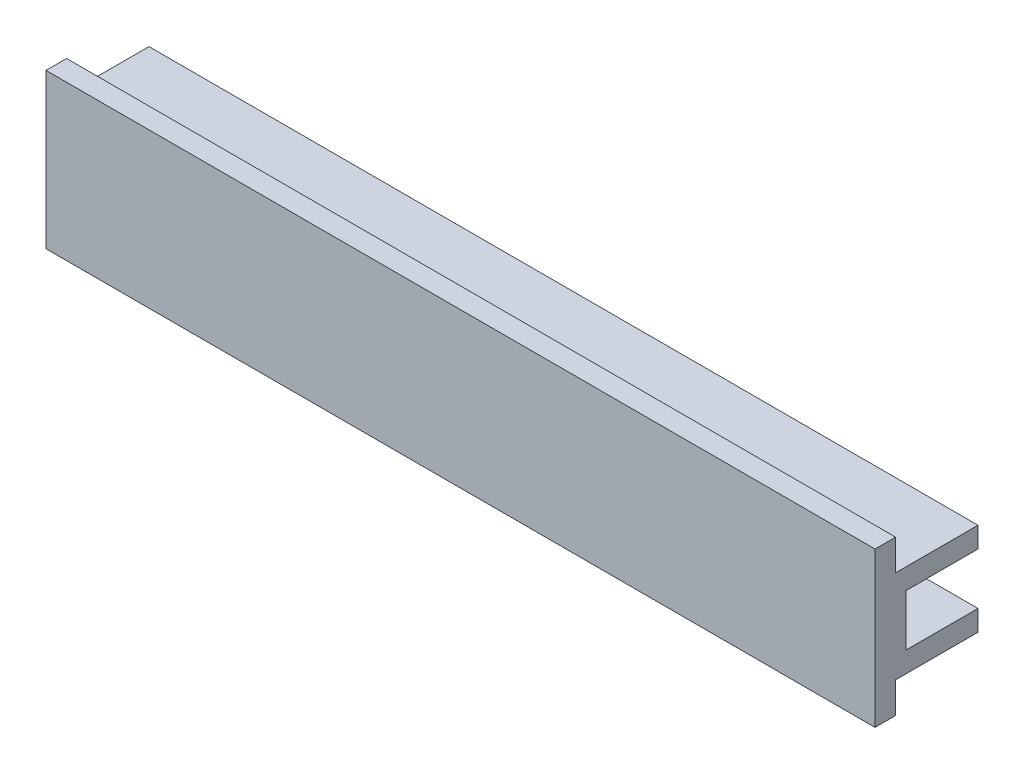
ISO-10303-21;
HEADER;
FILE_DESCRIPTION(('STEP AP214'),'2;1');
FILE_NAME('part.step','',(''),(''),'','','');
FILE_SCHEMA(('AUTOMOTIVE_DESIGN { 1 0 10303 214 1 1 1 1 }'));
ENDSEC;
DATA;
#1=APPLICATION_CONTEXT('core data for automotive mechanical design processes');
#2=APPLICATION_PROTOCOL_DEFINITION('international standard','automotive_design',2000,#1);
#3=PRODUCT_CONTEXT('',#1,'mechanical');
#4=PRODUCT('Part','Part','',(#3));
#5=PRODUCT_RELATED_PRODUCT_CATEGORY('part','',(#4));
#6=PRODUCT_DEFINITION_FORMATION('','',#4);
#7=PRODUCT_DEFINITION_CONTEXT('part definition',#1,'design');
#8=PRODUCT_DEFINITION('design','',#6,#7);
#9=PRODUCT_DEFINITION_SHAPE('','',#8);
#10=(LENGTH_UNIT() NAMED_UNIT(*) SI_UNIT(.MILLI.,.METRE.));
#11=(NAMED_UNIT(*) PLANE_ANGLE_UNIT() SI_UNIT($,.RADIAN.));
#12=(NAMED_UNIT(*) SI_UNIT($,.STERADIAN.) SOLID_ANGLE_UNIT());
#13=UNCERTAINTY_MEASURE_WITH_UNIT(LENGTH_MEASURE(1.E-05),#10,'distance_accuracy_value','');
#14=(GEOMETRIC_REPRESENTATION_CONTEXT(3) GLOBAL_UNCERTAINTY_ASSIGNED_CONTEXT((#13)) GLOBAL_UNIT_ASSIGNED_CONTEXT((#10,
#11,#12)) REPRESENTATION_CONTEXT('',''));
#15=CARTESIAN_POINT('',(0.,0.,0.));
#16=DIRECTION('',(0.,0.,1.));
#17=DIRECTION('',(1.,0.,0.));
#18=AXIS2_PLACEMENT_3D('',#15,#16,#17);
#19=CARTESIAN_POINT('',(40.25,7.5,5.));
#20=DIRECTION('',(0.,0.,-1.));
#21=DIRECTION('',(0.,1.,0.));
#22=AXIS2_PLACEMENT_3D('',#19,#20,#21);
#23=PLANE('',#22);
#24=DIRECTION('',(0.,-1.,0.));
#25=VECTOR('',#24,1.);
#26=CARTESIAN_POINT('',(-40.25,7.5,5.));
#27=LINE('',#26,#25);
#28=CARTESIAN_POINT('',(-40.25,7.5,5.));
#29=VERTEX_POINT('',#28);
#30=CARTESIAN_POINT('',(-40.25,-7.5,5.));
#31=VERTEX_POINT('',#30);
#32=EDGE_CURVE('E149',#29,#31,#27,.T.);
#33=ORIENTED_EDGE('',*,*,#32,.T.);
#34=DIRECTION('',(-1.,0.,0.));
#35=VECTOR('',#34,1.);
#36=CARTESIAN_POINT('',(40.25,-7.5,5.));
#37=LINE('',#36,#35);
#38=CARTESIAN_POINT('',(40.25,-7.5,5.));
#39=VERTEX_POINT('',#38);
#40=EDGE_CURVE('E11',#39,#31,#37,.T.);
#41=ORIENTED_EDGE('',*,*,#40,.F.);
#42=DIRECTION('',(0.,-1.,0.));
#43=VECTOR('',#42,1.);
#44=CARTESIAN_POINT('',(40.25,7.5,5.));
#45=LINE('',#44,#43);
#46=CARTESIAN_POINT('',(40.25,7.5,5.));
#47=VERTEX_POINT('',#46);
#48=EDGE_CURVE('E171',#47,#39,#45,.T.);
#49=ORIENTED_EDGE('',*,*,#48,.F.);
#50=DIRECTION('',(-1.,0.,0.));
#51=VECTOR('',#50,1.);
#52=CARTESIAN_POINT('',(40.25,7.5,5.));
#53=LINE('',#52,#51);
#54=EDGE_CURVE('E145',#47,#29,#53,.T.);
#55=ORIENTED_EDGE('',*,*,#54,.T.);
#56=EDGE_LOOP('',(#33,#41,#49,#55));
#57=FACE_BOUND('',#56,.T.);
#58=ADVANCED_FACE('F31',(#57),#23,.F.);
#59=CARTESIAN_POINT('',(40.25,-7.5,5.));
#60=DIRECTION('',(0.,1.,0.));
#61=DIRECTION('',(0.,0.,1.));
#62=AXIS2_PLACEMENT_3D('',#59,#60,#61);
#63=PLANE('',#62);
#64=DIRECTION('',(0.,0.,-1.));
#65=VECTOR('',#64,1.);
#66=CARTESIAN_POINT('',(-40.25,-7.5,5.));
#67=LINE('',#66,#65);
#68=CARTESIAN_POINT('',(-40.25,-7.5,3.));
#69=VERTEX_POINT('',#68);
#70=EDGE_CURVE('E152',#31,#69,#67,.T.);
#71=ORIENTED_EDGE('',*,*,#70,.T.);
#72=DIRECTION('',(-1.,0.,0.));
#73=VECTOR('',#72,1.);
#74=CARTESIAN_POINT('',(40.25,-7.5,3.));
#75=LINE('',#74,#73);
#76=CARTESIAN_POINT('',(40.25,-7.5,3.));
#77=VERTEX_POINT('',#76);
#78=EDGE_CURVE('E39',#77,#69,#75,.T.);
#79=ORIENTED_EDGE('',*,*,#78,.F.);
#80=DIRECTION('',(0.,0.,-1.));
#81=VECTOR('',#80,1.);
#82=CARTESIAN_POINT('',(40.25,-7.5,5.));
#83=LINE('',#82,#81);
#84=EDGE_CURVE('E97',#39,#77,#83,.T.);
#85=ORIENTED_EDGE('',*,*,#84,.F.);
#86=ORIENTED_EDGE('',*,*,#40,.T.);
#87=EDGE_LOOP('',(#71,#79,#85,#86));
#88=FACE_BOUND('',#87,.T.);
#89=ADVANCED_FACE('F250',(#88),#63,.F.);
#90=CARTESIAN_POINT('',(40.25,-4.5,3.));
#91=DIRECTION('',(0.,0.,1.));
#92=DIRECTION('',(1.,0.,0.));
#93=AXIS2_PLACEMENT_3D('',#90,#91,#92);
#94=PLANE('',#93);
#95=DIRECTION('',(0.,1.,0.));
#96=VECTOR('',#95,1.);
#97=CARTESIAN_POINT('',(-40.25,-4.5,3.));
#98=LINE('',#97,#96);
#99=CARTESIAN_POINT('',(-40.25,-4.5,3.));
#100=VERTEX_POINT('',#99);
#101=EDGE_CURVE('E155',#69,#100,#98,.T.);
#102=ORIENTED_EDGE('',*,*,#101,.T.);
#103=DIRECTION('',(-1.,0.,0.));
#104=VECTOR('',#103,1.);
#105=CARTESIAN_POINT('',(40.25,-4.5,3.));
#106=LINE('',#105,#104);
#107=CARTESIAN_POINT('',(40.25,-4.5,3.));
#108=VERTEX_POINT('',#107);
#109=EDGE_CURVE('E190',#108,#100,#106,.T.);
#110=ORIENTED_EDGE('',*,*,#109,.F.);
#111=DIRECTION('',(0.,1.,0.));
#112=VECTOR('',#111,1.);
#113=CARTESIAN_POINT('',(40.25,-4.5,3.));
#114=LINE('',#113,#112);
#115=EDGE_CURVE('E198',#77,#108,#114,.T.);
#116=ORIENTED_EDGE('',*,*,#115,.F.);
#117=ORIENTED_EDGE('',*,*,#78,.T.);
#118=EDGE_LOOP('',(#102,#110,#116,#117));
#119=FACE_BOUND('',#118,.T.);
#120=ADVANCED_FACE('F196',(#119),#94,.F.);
#121=CARTESIAN_POINT('',(40.25,-4.5,-5.));
#122=DIRECTION('',(0.,1.,0.));
#123=DIRECTION('',(0.,0.,1.));
#124=AXIS2_PLACEMENT_3D('',#121,#122,#123);
#125=PLANE('',#124);
#126=DIRECTION('',(0.,0.,-1.));
#127=VECTOR('',#126,1.);
#128=CARTESIAN_POINT('',(-40.25,-4.5,-5.));
#129=LINE('',#128,#127);
#130=CARTESIAN_POINT('',(-40.25,-4.5,-5.));
#131=VERTEX_POINT('',#130);
#132=EDGE_CURVE('E157',#100,#131,#129,.T.);
#133=ORIENTED_EDGE('',*,*,#132,.T.);
#134=DIRECTION('',(-1.,0.,0.));
#135=VECTOR('',#134,1.);
#136=CARTESIAN_POINT('',(40.25,-4.5,-5.));
#137=LINE('',#136,#135);
#138=CARTESIAN_POINT('',(40.25,-4.5,-5.));
#139=VERTEX_POINT('',#138);
#140=EDGE_CURVE('E187',#139,#131,#137,.T.);
#141=ORIENTED_EDGE('',*,*,#140,.F.);
#142=DIRECTION('',(0.,0.,-1.));
#143=VECTOR('',#142,1.);
#144=CARTESIAN_POINT('',(40.25,-4.5,-5.));
#145=LINE('',#144,#143);
#146=EDGE_CURVE('E217',#108,#139,#145,.T.);
#147=ORIENTED_EDGE('',*,*,#146,.F.);
#148=ORIENTED_EDGE('',*,*,#109,.T.);
#149=EDGE_LOOP('',(#133,#141,#147,#148));
#150=FACE_BOUND('',#149,.T.);
#151=ADVANCED_FACE('F208',(#150),#125,.F.);
#152=CARTESIAN_POINT('',(40.25,-2.5,-5.));
#153=DIRECTION('',(0.,0.,1.));
#154=DIRECTION('',(0.,-1.,0.));
#155=AXIS2_PLACEMENT_3D('',#152,#153,#154);
#156=PLANE('',#155);
#157=DIRECTION('',(0.,1.,0.));
#158=VECTOR('',#157,1.);
#159=CARTESIAN_POINT('',(-40.25,-2.5,-5.));
#160=LINE('',#159,#158);
#161=CARTESIAN_POINT('',(-40.25,-2.5,-5.));
#162=VERTEX_POINT('',#161);
#163=EDGE_CURVE('E159',#131,#162,#160,.T.);
#164=ORIENTED_EDGE('',*,*,#163,.T.);
#165=DIRECTION('',(-1.,0.,0.));
#166=VECTOR('',#165,1.);
#167=CARTESIAN_POINT('',(40.25,-2.5,-5.));
#168=LINE('',#167,#166);
#169=CARTESIAN_POINT('',(40.25,-2.5,-5.));
#170=VERTEX_POINT('',#169);
#171=EDGE_CURVE('E184',#170,#162,#168,.T.);
#172=ORIENTED_EDGE('',*,*,#171,.F.);
#173=DIRECTION('',(0.,1.,0.));
#174=VECTOR('',#173,1.);
#175=CARTESIAN_POINT('',(40.25,-2.5,-5.));
#176=LINE('',#175,#174);
#177=EDGE_CURVE('E214',#139,#170,#176,.T.);
#178=ORIENTED_EDGE('',*,*,#177,.F.);
#179=ORIENTED_EDGE('',*,*,#140,.T.);
#180=EDGE_LOOP('',(#164,#172,#178,#179));
#181=FACE_BOUND('',#180,.T.);
#182=ADVANCED_FACE('F212',(#181),#156,.F.);
#183=CARTESIAN_POINT('',(40.25,-2.5,2.));
#184=DIRECTION('',(0.,-1.,0.));
#185=DIRECTION('',(0.,0.,-1.));
#186=AXIS2_PLACEMENT_3D('',#183,#184,#185);
#187=PLANE('',#186);
#188=DIRECTION('',(0.,0.,1.));
#189=VECTOR('',#188,1.);
#190=CARTESIAN_POINT('',(-40.25,-2.5,2.));
#191=LINE('',#190,#189);
#192=CARTESIAN_POINT('',(-40.25,-2.5,3.));
#193=VERTEX_POINT('',#192);
#194=EDGE_CURVE('E161',#162,#193,#191,.T.);
#195=ORIENTED_EDGE('',*,*,#194,.T.);
#196=DIRECTION('',(-1.,0.,0.));
#197=VECTOR('',#196,1.);
#198=CARTESIAN_POINT('',(-18.25,-2.5,3.));
#199=LINE('',#198,#197);
#200=CARTESIAN_POINT('',(-18.25,-2.5,3.));
#201=VERTEX_POINT('',#200);
#202=EDGE_CURVE('E363',#201,#193,#199,.T.);
#203=ORIENTED_EDGE('',*,*,#202,.F.);
#204=DIRECTION('',(0.,0.,1.));
#205=VECTOR('',#204,1.);
#206=CARTESIAN_POINT('',(-18.25,-2.5,3.));
#207=LINE('',#206,#205);
#208=CARTESIAN_POINT('',(-18.25,-2.5,2.));
#209=VERTEX_POINT('',#208);
#210=EDGE_CURVE('E354',#209,#201,#207,.T.);
#211=ORIENTED_EDGE('',*,*,#210,.F.);
#212=DIRECTION('',(-1.,0.,0.));
#213=VECTOR('',#212,1.);
#214=CARTESIAN_POINT('',(40.25,-2.5,2.));
#215=LINE('',#214,#213);
#216=CARTESIAN_POINT('',(40.25,-2.5,2.));
#217=VERTEX_POINT('',#216);
#218=EDGE_CURVE('E181',#217,#209,#215,.T.);
#219=ORIENTED_EDGE('',*,*,#218,.F.);
#220=DIRECTION('',(0.,0.,1.));
#221=VECTOR('',#220,1.);
#222=CARTESIAN_POINT('',(40.25,-2.5,2.));
#223=LINE('',#222,#221);
#224=EDGE_CURVE('E216',#170,#217,#223,.T.);
#225=ORIENTED_EDGE('',*,*,#224,.F.);
#226=ORIENTED_EDGE('',*,*,#171,.T.);
#227=EDGE_LOOP('',(#195,#203,#211,#219,#225,#226));
#228=FACE_BOUND('',#227,.T.);
#229=ADVANCED_FACE('F263',(#228),#187,.F.);
#230=CARTESIAN_POINT('',(40.25,2.5,2.));
#231=DIRECTION('',(0.,0.,1.));
#232=DIRECTION('',(0.,-1.,0.));
#233=AXIS2_PLACEMENT_3D('',#230,#231,#232);
#234=PLANE('',#233);
#235=ORIENTED_EDGE('',*,*,#218,.T.);
#236=DIRECTION('',(0.,-1.,0.));
#237=VECTOR('',#236,1.);
#238=CARTESIAN_POINT('',(-18.25,-2.5,2.));
#239=LINE('',#238,#237);
#240=CARTESIAN_POINT('',(-18.25,2.5,2.));
#241=VERTEX_POINT('',#240);
#242=EDGE_CURVE('E350',#241,#209,#239,.T.);
#243=ORIENTED_EDGE('',*,*,#242,.F.);
#244=DIRECTION('',(-1.,0.,0.));
#245=VECTOR('',#244,1.);
#246=CARTESIAN_POINT('',(40.25,2.5,2.));
#247=LINE('',#246,#245);
#248=CARTESIAN_POINT('',(40.25,2.5,2.));
#249=VERTEX_POINT('',#248);
#250=EDGE_CURVE('E178',#249,#241,#247,.T.);
#251=ORIENTED_EDGE('',*,*,#250,.F.);
#252=DIRECTION('',(0.,1.,0.));
#253=VECTOR('',#252,1.);
#254=CARTESIAN_POINT('',(40.25,2.5,2.));
#255=LINE('',#254,#253);
#256=EDGE_CURVE('E219',#217,#249,#255,.T.);
#257=ORIENTED_EDGE('',*,*,#256,.F.);
#258=EDGE_LOOP('',(#235,#243,#251,#257));
#259=FACE_BOUND('',#258,.T.);
#260=ADVANCED_FACE('F266',(#259),#234,.F.);
#261=CARTESIAN_POINT('',(40.25,2.5,-5.));
#262=DIRECTION('',(0.,1.,0.));
#263=DIRECTION('',(0.,0.,1.));
#264=AXIS2_PLACEMENT_3D('',#261,#262,#263);
#265=PLANE('',#264);
#266=DIRECTION('',(0.,0.,-1.));
#267=VECTOR('',#266,1.);
#268=CARTESIAN_POINT('',(-40.25,2.5,-5.));
#269=LINE('',#268,#267);
#270=CARTESIAN_POINT('',(-40.25,2.5,3.));
#271=VERTEX_POINT('',#270);
#272=CARTESIAN_POINT('',(-40.25,2.5,-5.));
#273=VERTEX_POINT('',#272);
#274=EDGE_CURVE('E164',#271,#273,#269,.T.);
#275=ORIENTED_EDGE('',*,*,#274,.T.);
#276=DIRECTION('',(-1.,0.,0.));
#277=VECTOR('',#276,1.);
#278=CARTESIAN_POINT('',(40.25,2.5,-5.));
#279=LINE('',#278,#277);
#280=CARTESIAN_POINT('',(40.25,2.5,-5.));
#281=VERTEX_POINT('',#280);
#282=EDGE_CURVE('E175',#281,#273,#279,.T.);
#283=ORIENTED_EDGE('',*,*,#282,.F.);
#284=DIRECTION('',(0.,0.,-1.));
#285=VECTOR('',#284,1.);
#286=CARTESIAN_POINT('',(40.25,2.5,-5.));
#287=LINE('',#286,#285);
#288=EDGE_CURVE('E225',#249,#281,#287,.T.);
#289=ORIENTED_EDGE('',*,*,#288,.F.);
#290=ORIENTED_EDGE('',*,*,#250,.T.);
#291=DIRECTION('',(0.,0.,-1.));
#292=VECTOR('',#291,1.);
#293=CARTESIAN_POINT('',(-18.25,2.5,2.));
#294=LINE('',#293,#292);
#295=CARTESIAN_POINT('',(-18.25,2.5,3.));
#296=VERTEX_POINT('',#295);
#297=EDGE_CURVE('E356',#296,#241,#294,.T.);
#298=ORIENTED_EDGE('',*,*,#297,.F.);
#299=DIRECTION('',(-1.,0.,0.));
#300=VECTOR('',#299,1.);
#301=CARTESIAN_POINT('',(-18.25,2.5,3.));
#302=LINE('',#301,#300);
#303=EDGE_CURVE('E153',#296,#271,#302,.T.);
#304=ORIENTED_EDGE('',*,*,#303,.T.);
#305=EDGE_LOOP('',(#275,#283,#289,#290,#298,#304));
#306=FACE_BOUND('',#305,.T.);
#307=ADVANCED_FACE('F231',(#306),#265,.F.);
#308=CARTESIAN_POINT('',(40.25,4.5,-5.));
#309=DIRECTION('',(0.,0.,1.));
#310=DIRECTION('',(1.,0.,0.));
#311=AXIS2_PLACEMENT_3D('',#308,#309,#310);
#312=PLANE('',#311);
#313=DIRECTION('',(0.,1.,0.));
#314=VECTOR('',#313,1.);
#315=CARTESIAN_POINT('',(-40.25,4.5,-5.));
#316=LINE('',#315,#314);
#317=CARTESIAN_POINT('',(-40.25,4.5,-5.));
#318=VERTEX_POINT('',#317);
#319=EDGE_CURVE('E166',#273,#318,#316,.T.);
#320=ORIENTED_EDGE('',*,*,#319,.T.);
#321=DIRECTION('',(-1.,0.,0.));
#322=VECTOR('',#321,1.);
#323=CARTESIAN_POINT('',(40.25,4.5,-5.));
#324=LINE('',#323,#322);
#325=CARTESIAN_POINT('',(40.25,4.5,-5.));
#326=VERTEX_POINT('',#325);
#327=EDGE_CURVE('E140',#326,#318,#324,.T.);
#328=ORIENTED_EDGE('',*,*,#327,.F.);
#329=DIRECTION('',(0.,1.,0.));
#330=VECTOR('',#329,1.);
#331=CARTESIAN_POINT('',(40.25,4.5,-5.));
#332=LINE('',#331,#330);
#333=EDGE_CURVE('E131',#281,#326,#332,.T.);
#334=ORIENTED_EDGE('',*,*,#333,.F.);
#335=ORIENTED_EDGE('',*,*,#282,.T.);
#336=EDGE_LOOP('',(#320,#328,#334,#335));
#337=FACE_BOUND('',#336,.T.);
#338=ADVANCED_FACE('F235',(#337),#312,.F.);
#339=CARTESIAN_POINT('',(40.25,4.5,3.));
#340=DIRECTION('',(0.,-1.,0.));
#341=DIRECTION('',(0.,0.,-1.));
#342=AXIS2_PLACEMENT_3D('',#339,#340,#341);
#343=PLANE('',#342);
#344=DIRECTION('',(0.,0.,1.));
#345=VECTOR('',#344,1.);
#346=CARTESIAN_POINT('',(-40.25,4.5,3.));
#347=LINE('',#346,#345);
#348=CARTESIAN_POINT('',(-40.25,4.5,3.));
#349=VERTEX_POINT('',#348);
#350=EDGE_CURVE('E139',#318,#349,#347,.T.);
#351=ORIENTED_EDGE('',*,*,#350,.T.);
#352=DIRECTION('',(-1.,0.,0.));
#353=VECTOR('',#352,1.);
#354=CARTESIAN_POINT('',(40.25,4.5,3.));
#355=LINE('',#354,#353);
#356=CARTESIAN_POINT('',(40.25,4.5,3.));
#357=VERTEX_POINT('',#356);
#358=EDGE_CURVE('E136',#357,#349,#355,.T.);
#359=ORIENTED_EDGE('',*,*,#358,.F.);
#360=DIRECTION('',(0.,0.,1.));
#361=VECTOR('',#360,1.);
#362=CARTESIAN_POINT('',(40.25,4.5,3.));
#363=LINE('',#362,#361);
#364=EDGE_CURVE('E125',#326,#357,#363,.T.);
#365=ORIENTED_EDGE('',*,*,#364,.F.);
#366=ORIENTED_EDGE('',*,*,#327,.T.);
#367=EDGE_LOOP('',(#351,#359,#365,#366));
#368=FACE_BOUND('',#367,.T.);
#369=ADVANCED_FACE('F137',(#368),#343,.F.);
#370=CARTESIAN_POINT('',(40.25,7.5,3.));
#371=DIRECTION('',(0.,0.,1.));
#372=DIRECTION('',(0.,-1.,0.));
#373=AXIS2_PLACEMENT_3D('',#370,#371,#372);
#374=PLANE('',#373);
#375=DIRECTION('',(0.,1.,0.));
#376=VECTOR('',#375,1.);
#377=CARTESIAN_POINT('',(-40.25,7.5,3.));
#378=LINE('',#377,#376);
#379=CARTESIAN_POINT('',(-40.25,7.5,3.));
#380=VERTEX_POINT('',#379);
#381=EDGE_CURVE('E83',#349,#380,#378,.T.);
#382=ORIENTED_EDGE('',*,*,#381,.T.);
#383=DIRECTION('',(-1.,0.,0.));
#384=VECTOR('',#383,1.);
#385=CARTESIAN_POINT('',(40.25,7.5,3.));
#386=LINE('',#385,#384);
#387=CARTESIAN_POINT('',(40.25,7.5,3.));
#388=VERTEX_POINT('',#387);
#389=EDGE_CURVE('E141',#388,#380,#386,.T.);
#390=ORIENTED_EDGE('',*,*,#389,.F.);
#391=DIRECTION('',(0.,1.,0.));
#392=VECTOR('',#391,1.);
#393=CARTESIAN_POINT('',(40.25,7.5,3.));
#394=LINE('',#393,#392);
#395=EDGE_CURVE('E129',#357,#388,#394,.T.);
#396=ORIENTED_EDGE('',*,*,#395,.F.);
#397=ORIENTED_EDGE('',*,*,#358,.T.);
#398=EDGE_LOOP('',(#382,#390,#396,#397));
#399=FACE_BOUND('',#398,.T.);
#400=ADVANCED_FACE('F143',(#399),#374,.F.);
#401=CARTESIAN_POINT('',(40.25,7.5,5.));
#402=DIRECTION('',(0.,-1.,0.));
#403=DIRECTION('',(0.,0.,-1.));
#404=AXIS2_PLACEMENT_3D('',#401,#402,#403);
#405=PLANE('',#404);
#406=DIRECTION('',(0.,0.,1.));
#407=VECTOR('',#406,1.);
#408=CARTESIAN_POINT('',(-40.25,7.5,5.));
#409=LINE('',#408,#407);
#410=EDGE_CURVE('E89',#380,#29,#409,.T.);
#411=ORIENTED_EDGE('',*,*,#410,.T.);
#412=ORIENTED_EDGE('',*,*,#54,.F.);
#413=DIRECTION('',(0.,0.,1.));
#414=VECTOR('',#413,1.);
#415=CARTESIAN_POINT('',(40.25,7.5,5.));
#416=LINE('',#415,#414);
#417=EDGE_CURVE('E47',#388,#47,#416,.T.);
#418=ORIENTED_EDGE('',*,*,#417,.F.);
#419=ORIENTED_EDGE('',*,*,#389,.T.);
#420=EDGE_LOOP('',(#411,#412,#418,#419));
#421=FACE_BOUND('',#420,.T.);
#422=ADVANCED_FACE('F239',(#421),#405,.F.);
#423=CARTESIAN_POINT('',(40.25,-7.5,5.));
#424=DIRECTION('',(1.,0.,0.));
#425=DIRECTION('',(0.,0.,-1.));
#426=AXIS2_PLACEMENT_3D('',#423,#424,#425);
#427=PLANE('',#426);
#428=ORIENTED_EDGE('',*,*,#48,.T.);
#429=ORIENTED_EDGE('',*,*,#84,.T.);
#430=ORIENTED_EDGE('',*,*,#115,.T.);
#431=ORIENTED_EDGE('',*,*,#146,.T.);
#432=ORIENTED_EDGE('',*,*,#177,.T.);
#433=ORIENTED_EDGE('',*,*,#224,.T.);
#434=ORIENTED_EDGE('',*,*,#256,.T.);
#435=ORIENTED_EDGE('',*,*,#288,.T.);
#436=ORIENTED_EDGE('',*,*,#333,.T.);
#437=ORIENTED_EDGE('',*,*,#364,.T.);
#438=ORIENTED_EDGE('',*,*,#395,.T.);
#439=ORIENTED_EDGE('',*,*,#417,.T.);
#440=EDGE_LOOP('',(#428,#429,#430,#431,#432,#433,#434,#435,#436,#437,#438,#439));
#441=FACE_BOUND('',#440,.T.);
#442=ADVANCED_FACE('F127',(#441),#427,.T.);
#443=CARTESIAN_POINT('',(-40.25,-7.5,5.));
#444=DIRECTION('',(1.,0.,0.));
#445=DIRECTION('',(0.,0.,-1.));
#446=AXIS2_PLACEMENT_3D('',#443,#444,#445);
#447=PLANE('',#446);
#448=ORIENTED_EDGE('',*,*,#274,.F.);
#449=DIRECTION('',(0.,1.,0.));
#450=VECTOR('',#449,1.);
#451=CARTESIAN_POINT('',(-40.25,2.5,3.));
#452=LINE('',#451,#450);
#453=EDGE_CURVE('E358',#193,#271,#452,.T.);
#454=ORIENTED_EDGE('',*,*,#453,.F.);
#455=ORIENTED_EDGE('',*,*,#194,.F.);
#456=ORIENTED_EDGE('',*,*,#163,.F.);
#457=ORIENTED_EDGE('',*,*,#132,.F.);
#458=ORIENTED_EDGE('',*,*,#101,.F.);
#459=ORIENTED_EDGE('',*,*,#70,.F.);
#460=ORIENTED_EDGE('',*,*,#32,.F.);
#461=ORIENTED_EDGE('',*,*,#410,.F.);
#462=ORIENTED_EDGE('',*,*,#381,.F.);
#463=ORIENTED_EDGE('',*,*,#350,.F.);
#464=ORIENTED_EDGE('',*,*,#319,.F.);
#465=EDGE_LOOP('',(#448,#454,#455,#456,#457,#458,#459,#460,#461,#462,#463,#464));
#466=FACE_BOUND('',#465,.T.);
#467=ADVANCED_FACE('F202',(#466),#447,.F.);
#468=CARTESIAN_POINT('',(-18.25,2.5,3.));
#469=DIRECTION('',(0.,0.,1.));
#470=DIRECTION('',(0.,-1.,0.));
#471=AXIS2_PLACEMENT_3D('',#468,#469,#470);
#472=PLANE('',#471);
#473=ORIENTED_EDGE('',*,*,#453,.T.);
#474=ORIENTED_EDGE('',*,*,#303,.F.);
#475=DIRECTION('',(0.,1.,0.));
#476=VECTOR('',#475,1.);
#477=CARTESIAN_POINT('',(-18.25,2.5,3.));
#478=LINE('',#477,#476);
#479=EDGE_CURVE('E365',#201,#296,#478,.T.);
#480=ORIENTED_EDGE('',*,*,#479,.F.);
#481=ORIENTED_EDGE('',*,*,#202,.T.);
#482=EDGE_LOOP('',(#473,#474,#480,#481));
#483=FACE_BOUND('',#482,.T.);
#484=ADVANCED_FACE('F324',(#483),#472,.F.);
#485=CARTESIAN_POINT('',(-18.25,2.5,2.));
#486=DIRECTION('',(1.,0.,0.));
#487=DIRECTION('',(0.,0.,-1.));
#488=AXIS2_PLACEMENT_3D('',#485,#486,#487);
#489=PLANE('',#488);
#490=ORIENTED_EDGE('',*,*,#242,.T.);
#491=ORIENTED_EDGE('',*,*,#210,.T.);
#492=ORIENTED_EDGE('',*,*,#479,.T.);
#493=ORIENTED_EDGE('',*,*,#297,.T.);
#494=EDGE_LOOP('',(#490,#491,#492,#493));
#495=FACE_BOUND('',#494,.T.);
#496=ADVANCED_FACE('F331',(#495),#489,.F.);
#497=CLOSED_SHELL('',(#58,#89,#120,#151,#182,#229,#260,#307,#338,#369,#400,#422,#442,#467,#484,#496));
#498=MANIFOLD_SOLID_BREP('B2',#497);
#499=ADVANCED_BREP_SHAPE_REPRESENTATION('',(#18,#498),#14);
#500=SHAPE_DEFINITION_REPRESENTATION(#9,#499);
ENDSEC;
END-ISO-10303-21;
